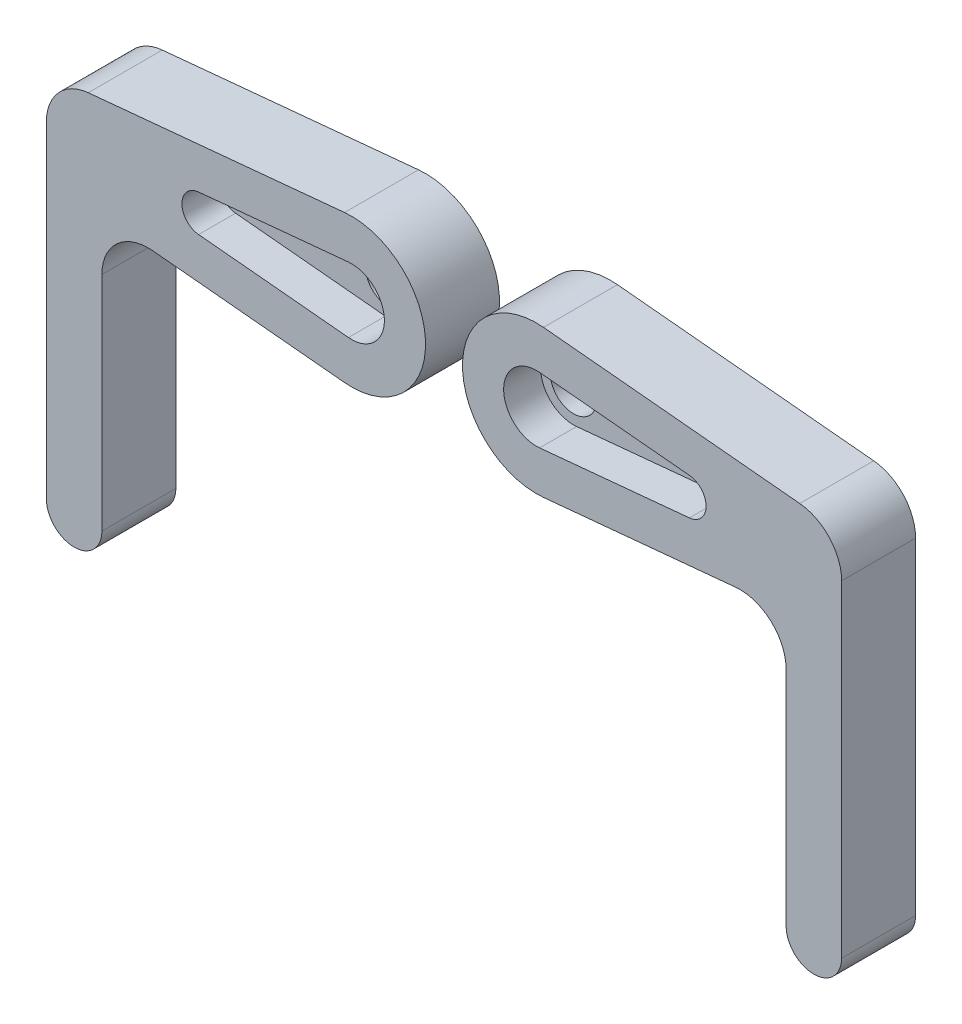
ISO-10303-21;
HEADER;
FILE_DESCRIPTION(('STEP AP214'),'2;1');
FILE_NAME('part.step','',(''),(''),'','','');
FILE_SCHEMA(('AUTOMOTIVE_DESIGN { 1 0 10303 214 1 1 1 1 }'));
ENDSEC;
DATA;
#1=APPLICATION_CONTEXT('core data for automotive mechanical design processes');
#2=APPLICATION_PROTOCOL_DEFINITION('international standard','automotive_design',2000,#1);
#3=PRODUCT_CONTEXT('',#1,'mechanical');
#4=PRODUCT('Part','Part','',(#3));
#5=PRODUCT_RELATED_PRODUCT_CATEGORY('part','',(#4));
#6=PRODUCT_DEFINITION_FORMATION('','',#4);
#7=PRODUCT_DEFINITION_CONTEXT('part definition',#1,'design');
#8=PRODUCT_DEFINITION('design','',#6,#7);
#9=PRODUCT_DEFINITION_SHAPE('','',#8);
#10=(LENGTH_UNIT() NAMED_UNIT(*) SI_UNIT(.MILLI.,.METRE.));
#11=(NAMED_UNIT(*) PLANE_ANGLE_UNIT() SI_UNIT($,.RADIAN.));
#12=(NAMED_UNIT(*) SI_UNIT($,.STERADIAN.) SOLID_ANGLE_UNIT());
#13=UNCERTAINTY_MEASURE_WITH_UNIT(LENGTH_MEASURE(1.E-05),#10,'distance_accuracy_value','');
#14=(GEOMETRIC_REPRESENTATION_CONTEXT(3) GLOBAL_UNCERTAINTY_ASSIGNED_CONTEXT((#13)) GLOBAL_UNIT_ASSIGNED_CONTEXT((#10,
#11,#12)) REPRESENTATION_CONTEXT('',''));
#15=CARTESIAN_POINT('',(0.,0.,0.));
#16=DIRECTION('',(0.,0.,1.));
#17=DIRECTION('',(1.,0.,0.));
#18=AXIS2_PLACEMENT_3D('',#15,#16,#17);
#19=CARTESIAN_POINT('',(-20.,0.,4.));
#20=DIRECTION('',(0.,0.,-1.));
#21=DIRECTION('',(1.,0.,0.));
#22=AXIS2_PLACEMENT_3D('',#19,#20,#21);
#23=PLANE('',#22);
#24=DIRECTION('',(0.,1.,0.));
#25=VECTOR('',#24,1.);
#26=CARTESIAN_POINT('',(-53.,-35.,4.));
#27=LINE('',#26,#25);
#28=CARTESIAN_POINT('',(-53.,-35.,4.));
#29=VERTEX_POINT('',#28);
#30=CARTESIAN_POINT('',(-53.,0.347129141817851,4.));
#31=VERTEX_POINT('',#30);
#32=EDGE_CURVE('E164',#29,#31,#27,.T.);
#33=ORIENTED_EDGE('',*,*,#32,.F.);
#34=CARTESIAN_POINT('',(-50.,-35.,4.));
#35=DIRECTION('',(0.,0.,-1.));
#36=DIRECTION('',(1.,0.,0.));
#37=AXIS2_PLACEMENT_3D('',#34,#35,#36);
#38=CIRCLE('',#37,3.);
#39=CARTESIAN_POINT('',(-47.,-35.,4.));
#40=VERTEX_POINT('',#39);
#41=EDGE_CURVE('E233',#40,#29,#38,.T.);
#42=ORIENTED_EDGE('',*,*,#41,.F.);
#43=DIRECTION('',(0.,-1.,0.));
#44=VECTOR('',#43,1.);
#45=CARTESIAN_POINT('',(-47.,-5.46498002915011,4.));
#46=LINE('',#45,#44);
#47=CARTESIAN_POINT('',(-47.,-10.9637513906896,4.));
#48=VERTEX_POINT('',#47);
#49=EDGE_CURVE('E231',#48,#40,#46,.T.);
#50=ORIENTED_EDGE('',*,*,#49,.F.);
#51=CARTESIAN_POINT('',(-42.,-10.9637513906896,4.));
#52=DIRECTION('',(0.,0.,1.));
#53=DIRECTION('',(1.,0.,0.));
#54=AXIS2_PLACEMENT_3D('',#51,#52,#53);
#55=CIRCLE('',#54,5.);
#56=CARTESIAN_POINT('',(-41.525993883792,-5.98627028054987,4.));
#57=VERTEX_POINT('',#56);
#58=EDGE_CURVE('E12',#57,#48,#55,.T.);
#59=ORIENTED_EDGE('',*,*,#58,.F.);
#60=DIRECTION('',(-0.995496222027938,0.0948012232415903,0.));
#61=VECTOR('',#60,1.);
#62=CARTESIAN_POINT('',(-20.7584097859327,-7.96396977622351,4.));
#63=LINE('',#62,#61);
#64=CARTESIAN_POINT('',(-20.7584097859327,-7.96396977622351,4.));
#65=VERTEX_POINT('',#64);
#66=EDGE_CURVE('E185',#65,#57,#63,.T.);
#67=ORIENTED_EDGE('',*,*,#66,.F.);
#68=CARTESIAN_POINT('',(-20.,0.,4.));
#69=DIRECTION('',(0.,0.,-1.));
#70=DIRECTION('',(1.,0.,0.));
#71=AXIS2_PLACEMENT_3D('',#68,#69,#70);
#72=CIRCLE('',#71,8.);
#73=CARTESIAN_POINT('',(-20.7584097859327,7.96396977622351,4.));
#74=VERTEX_POINT('',#73);
#75=EDGE_CURVE('E228',#74,#65,#72,.T.);
#76=ORIENTED_EDGE('',*,*,#75,.F.);
#77=DIRECTION('',(0.995496222027938,0.0948012232415902,0.));
#78=VECTOR('',#77,1.);
#79=CARTESIAN_POINT('',(-20.7584097859327,7.96396977622351,4.));
#80=LINE('',#79,#78);
#81=CARTESIAN_POINT('',(-48.4740061162079,5.32461025195755,4.));
#82=VERTEX_POINT('',#81);
#83=EDGE_CURVE('E157',#82,#74,#80,.T.);
#84=ORIENTED_EDGE('',*,*,#83,.F.);
#85=CARTESIAN_POINT('',(-48.,0.347129141817853,4.));
#86=DIRECTION('',(0.,0.,1.));
#87=DIRECTION('',(1.,0.,0.));
#88=AXIS2_PLACEMENT_3D('',#85,#86,#87);
#89=CIRCLE('',#88,5.);
#90=EDGE_CURVE('E176',#31,#82,#89,.F.);
#91=ORIENTED_EDGE('',*,*,#90,.F.);
#92=EDGE_LOOP('',(#33,#42,#50,#59,#67,#76,#84,#91));
#93=FACE_BOUND('',#92,.T.);
#94=CARTESIAN_POINT('',(-20.,0.,4.));
#95=DIRECTION('',(0.,0.,-1.));
#96=DIRECTION('',(-1.,0.,0.));
#97=AXIS2_PLACEMENT_3D('',#94,#95,#96);
#98=CIRCLE('',#97,3.55);
#99=CARTESIAN_POINT('',(-20.3365443425076,3.53401158819918,4.));
#100=VERTEX_POINT('',#99);
#101=CARTESIAN_POINT('',(-20.3365443425076,-3.53401158819918,4.));
#102=VERTEX_POINT('',#101);
#103=EDGE_CURVE('E197',#100,#102,#98,.T.);
#104=ORIENTED_EDGE('',*,*,#103,.T.);
#105=DIRECTION('',(-0.995496222027938,0.0948012232415903,0.));
#106=VECTOR('',#105,1.);
#107=CARTESIAN_POINT('',(-36.5396024464832,-1.99099244405587,4.));
#108=LINE('',#107,#106);
#109=CARTESIAN_POINT('',(-36.5396024464832,-1.99099244405587,4.));
#110=VERTEX_POINT('',#109);
#111=EDGE_CURVE('E200',#102,#110,#108,.T.);
#112=ORIENTED_EDGE('',*,*,#111,.T.);
#113=CARTESIAN_POINT('',(-36.35,0.,4.));
#114=DIRECTION('',(0.,0.,-1.));
#115=DIRECTION('',(-1.,0.,0.));
#116=AXIS2_PLACEMENT_3D('',#113,#114,#115);
#117=CIRCLE('',#116,2.);
#118=CARTESIAN_POINT('',(-36.5396024464832,1.99099244405587,4.));
#119=VERTEX_POINT('',#118);
#120=EDGE_CURVE('E204',#110,#119,#117,.T.);
#121=ORIENTED_EDGE('',*,*,#120,.T.);
#122=DIRECTION('',(0.995496222027938,0.0948012232415904,0.));
#123=VECTOR('',#122,1.);
#124=CARTESIAN_POINT('',(-20.3365443425076,3.53401158819918,4.));
#125=LINE('',#124,#123);
#126=EDGE_CURVE('E207',#119,#100,#125,.T.);
#127=ORIENTED_EDGE('',*,*,#126,.T.);
#128=EDGE_LOOP('',(#104,#112,#121,#127));
#129=FACE_BOUND('',#128,.T.);
#130=ADVANCED_FACE('F43',(#93,#129),#23,.F.);
#131=CARTESIAN_POINT('',(-20.,0.,4.));
#132=DIRECTION('',(0.,0.,-1.));
#133=DIRECTION('',(1.,0.,0.));
#134=AXIS2_PLACEMENT_3D('',#131,#132,#133);
#135=CYLINDRICAL_SURFACE('',#134,8.);
#136=DIRECTION('',(0.,0.,-1.));
#137=VECTOR('',#136,1.);
#138=CARTESIAN_POINT('',(-20.7584097859327,7.96396977622351,4.));
#139=LINE('',#138,#137);
#140=CARTESIAN_POINT('',(-20.7584097859327,7.96396977622351,-4.));
#141=VERTEX_POINT('',#140);
#142=EDGE_CURVE('E150',#74,#141,#139,.T.);
#143=ORIENTED_EDGE('',*,*,#142,.F.);
#144=ORIENTED_EDGE('',*,*,#75,.T.);
#145=DIRECTION('',(0.,0.,-1.));
#146=VECTOR('',#145,1.);
#147=CARTESIAN_POINT('',(-20.7584097859327,-7.96396977622351,4.));
#148=LINE('',#147,#146);
#149=CARTESIAN_POINT('',(-20.7584097859327,-7.9639697762235,-4.));
#150=VERTEX_POINT('',#149);
#151=EDGE_CURVE('E152',#65,#150,#148,.T.);
#152=ORIENTED_EDGE('',*,*,#151,.T.);
#153=CARTESIAN_POINT('',(-20.,0.,-4.));
#154=DIRECTION('',(0.,0.,1.));
#155=DIRECTION('',(1.,0.,0.));
#156=AXIS2_PLACEMENT_3D('',#153,#154,#155);
#157=CIRCLE('',#156,8.);
#158=EDGE_CURVE('E138',#150,#141,#157,.T.);
#159=ORIENTED_EDGE('',*,*,#158,.T.);
#160=EDGE_LOOP('',(#143,#144,#152,#159));
#161=FACE_BOUND('',#160,.T.);
#162=ADVANCED_FACE('F148',(#161),#135,.T.);
#163=CARTESIAN_POINT('',(-20.7584097859327,-7.96396977622351,4.));
#164=DIRECTION('',(0.0948012232415903,0.995496222027938,0.));
#165=DIRECTION('',(0.995496222027938,-0.0948012232415903,0.));
#166=AXIS2_PLACEMENT_3D('',#163,#164,#165);
#167=PLANE('',#166);
#168=DIRECTION('',(0.995496222027938,-0.0948012232415902,0.));
#169=VECTOR('',#168,1.);
#170=CARTESIAN_POINT('',(-20.7584097859327,-7.9639697762235,-4.));
#171=LINE('',#170,#169);
#172=CARTESIAN_POINT('',(-41.525993883792,-5.98627028054987,-4.));
#173=VERTEX_POINT('',#172);
#174=EDGE_CURVE('E183',#173,#150,#171,.T.);
#175=ORIENTED_EDGE('',*,*,#174,.T.);
#176=ORIENTED_EDGE('',*,*,#151,.F.);
#177=ORIENTED_EDGE('',*,*,#66,.T.);
#178=DIRECTION('',(0.,0.,-1.));
#179=VECTOR('',#178,1.);
#180=CARTESIAN_POINT('',(-41.525993883792,-5.98627028054987,4.));
#181=LINE('',#180,#179);
#182=EDGE_CURVE('E64',#173,#57,#181,.F.);
#183=ORIENTED_EDGE('',*,*,#182,.F.);
#184=EDGE_LOOP('',(#175,#176,#177,#183));
#185=FACE_BOUND('',#184,.T.);
#186=ADVANCED_FACE('F182',(#185),#167,.F.);
#187=CARTESIAN_POINT('',(-47.,-5.46498002915011,4.));
#188=DIRECTION('',(-1.,0.,0.));
#189=DIRECTION('',(0.,0.,-1.));
#190=AXIS2_PLACEMENT_3D('',#187,#188,#189);
#191=PLANE('',#190);
#192=ORIENTED_EDGE('',*,*,#49,.T.);
#193=DIRECTION('',(0.,0.,-1.));
#194=VECTOR('',#193,1.);
#195=CARTESIAN_POINT('',(-47.,-35.,4.));
#196=LINE('',#195,#194);
#197=CARTESIAN_POINT('',(-47.,-35.,-4.));
#198=VERTEX_POINT('',#197);
#199=EDGE_CURVE('E162',#40,#198,#196,.T.);
#200=ORIENTED_EDGE('',*,*,#199,.T.);
#201=DIRECTION('',(0.,1.,0.));
#202=VECTOR('',#201,1.);
#203=CARTESIAN_POINT('',(-47.,-5.46498002915011,-4.));
#204=LINE('',#203,#202);
#205=CARTESIAN_POINT('',(-47.,-10.9637513906896,-4.));
#206=VERTEX_POINT('',#205);
#207=EDGE_CURVE('E188',#198,#206,#204,.T.);
#208=ORIENTED_EDGE('',*,*,#207,.T.);
#209=DIRECTION('',(0.,0.,-1.));
#210=VECTOR('',#209,1.);
#211=CARTESIAN_POINT('',(-47.,-10.9637513906896,-4.));
#212=LINE('',#211,#210);
#213=EDGE_CURVE('E58',#48,#206,#212,.T.);
#214=ORIENTED_EDGE('',*,*,#213,.F.);
#215=EDGE_LOOP('',(#192,#200,#208,#214));
#216=FACE_BOUND('',#215,.T.);
#217=ADVANCED_FACE('F273',(#216),#191,.F.);
#218=CARTESIAN_POINT('',(-50.,-35.,4.));
#219=DIRECTION('',(0.,0.,-1.));
#220=DIRECTION('',(1.,0.,0.));
#221=AXIS2_PLACEMENT_3D('',#218,#219,#220);
#222=CYLINDRICAL_SURFACE('',#221,3.);
#223=ORIENTED_EDGE('',*,*,#199,.F.);
#224=ORIENTED_EDGE('',*,*,#41,.T.);
#225=DIRECTION('',(0.,0.,-1.));
#226=VECTOR('',#225,1.);
#227=CARTESIAN_POINT('',(-53.,-35.,4.));
#228=LINE('',#227,#226);
#229=CARTESIAN_POINT('',(-53.,-35.,-4.));
#230=VERTEX_POINT('',#229);
#231=EDGE_CURVE('E159',#29,#230,#228,.T.);
#232=ORIENTED_EDGE('',*,*,#231,.T.);
#233=CARTESIAN_POINT('',(-50.,-35.,-4.));
#234=DIRECTION('',(0.,0.,1.));
#235=DIRECTION('',(-1.,0.,0.));
#236=AXIS2_PLACEMENT_3D('',#233,#234,#235);
#237=CIRCLE('',#236,3.);
#238=EDGE_CURVE('E193',#230,#198,#237,.T.);
#239=ORIENTED_EDGE('',*,*,#238,.T.);
#240=EDGE_LOOP('',(#223,#224,#232,#239));
#241=FACE_BOUND('',#240,.T.);
#242=ADVANCED_FACE('F270',(#241),#222,.T.);
#243=CARTESIAN_POINT('',(-53.,-35.,4.));
#244=DIRECTION('',(1.,0.,0.));
#245=DIRECTION('',(0.,0.,1.));
#246=AXIS2_PLACEMENT_3D('',#243,#244,#245);
#247=PLANE('',#246);
#248=DIRECTION('',(0.,-1.,0.));
#249=VECTOR('',#248,1.);
#250=CARTESIAN_POINT('',(-53.,4.8935993178393,-4.));
#251=LINE('',#250,#249);
#252=CARTESIAN_POINT('',(-53.,0.347129141817853,-4.));
#253=VERTEX_POINT('',#252);
#254=EDGE_CURVE('E145',#253,#230,#251,.T.);
#255=ORIENTED_EDGE('',*,*,#254,.T.);
#256=ORIENTED_EDGE('',*,*,#231,.F.);
#257=ORIENTED_EDGE('',*,*,#32,.T.);
#258=DIRECTION('',(0.,0.,-1.));
#259=VECTOR('',#258,1.);
#260=CARTESIAN_POINT('',(-53.,0.347129141817851,4.));
#261=LINE('',#260,#259);
#262=EDGE_CURVE('E174',#253,#31,#261,.F.);
#263=ORIENTED_EDGE('',*,*,#262,.F.);
#264=EDGE_LOOP('',(#255,#256,#257,#263));
#265=FACE_BOUND('',#264,.T.);
#266=ADVANCED_FACE('F239',(#265),#247,.F.);
#267=CARTESIAN_POINT('',(-20.7584097859327,7.96396977622351,4.));
#268=DIRECTION('',(0.0948012232415903,-0.995496222027938,0.));
#269=DIRECTION('',(-0.995496222027938,-0.0948012232415903,0.));
#270=AXIS2_PLACEMENT_3D('',#267,#268,#269);
#271=PLANE('',#270);
#272=ORIENTED_EDGE('',*,*,#83,.T.);
#273=ORIENTED_EDGE('',*,*,#142,.T.);
#274=DIRECTION('',(-0.995496222027938,-0.0948012232415902,0.));
#275=VECTOR('',#274,1.);
#276=CARTESIAN_POINT('',(-20.7584097859327,7.96396977622351,-4.));
#277=LINE('',#276,#275);
#278=CARTESIAN_POINT('',(-48.4740061162079,5.32461025195755,-4.));
#279=VERTEX_POINT('',#278);
#280=EDGE_CURVE('E133',#141,#279,#277,.T.);
#281=ORIENTED_EDGE('',*,*,#280,.T.);
#282=DIRECTION('',(0.,0.,-1.));
#283=VECTOR('',#282,1.);
#284=CARTESIAN_POINT('',(-48.474006116208,5.32461025195755,4.));
#285=LINE('',#284,#283);
#286=EDGE_CURVE('E171',#82,#279,#285,.T.);
#287=ORIENTED_EDGE('',*,*,#286,.F.);
#288=EDGE_LOOP('',(#272,#273,#281,#287));
#289=FACE_BOUND('',#288,.T.);
#290=ADVANCED_FACE('F155',(#289),#271,.F.);
#291=CARTESIAN_POINT('',(-20.,0.,4.));
#292=DIRECTION('',(0.,0.,-1.));
#293=DIRECTION('',(1.,0.,0.));
#294=AXIS2_PLACEMENT_3D('',#291,#292,#293);
#295=CYLINDRICAL_SURFACE('',#294,3.55);
#296=CARTESIAN_POINT('',(-20.,0.,0.));
#297=DIRECTION('',(0.,0.,-1.));
#298=DIRECTION('',(-1.,0.,0.));
#299=AXIS2_PLACEMENT_3D('',#296,#297,#298);
#300=CIRCLE('',#299,3.55);
#301=CARTESIAN_POINT('',(-20.3365443425076,3.53401158819918,0.));
#302=VERTEX_POINT('',#301);
#303=CARTESIAN_POINT('',(-20.3365443425076,-3.53401158819918,0.));
#304=VERTEX_POINT('',#303);
#305=EDGE_CURVE('E187',#302,#304,#300,.T.);
#306=ORIENTED_EDGE('',*,*,#305,.T.);
#307=DIRECTION('',(0.,0.,-1.));
#308=VECTOR('',#307,1.);
#309=CARTESIAN_POINT('',(-20.3365443425076,-3.53401158819918,4.));
#310=LINE('',#309,#308);
#311=EDGE_CURVE('E225',#102,#304,#310,.T.);
#312=ORIENTED_EDGE('',*,*,#311,.F.);
#313=ORIENTED_EDGE('',*,*,#103,.F.);
#314=DIRECTION('',(0.,0.,-1.));
#315=VECTOR('',#314,1.);
#316=CARTESIAN_POINT('',(-20.3365443425076,3.53401158819918,4.));
#317=LINE('',#316,#315);
#318=EDGE_CURVE('E209',#100,#302,#317,.T.);
#319=ORIENTED_EDGE('',*,*,#318,.T.);
#320=EDGE_LOOP('',(#306,#312,#313,#319));
#321=FACE_BOUND('',#320,.T.);
#322=ADVANCED_FACE('F264',(#321),#295,.F.);
#323=CARTESIAN_POINT('',(-36.5396024464832,-1.99099244405587,4.));
#324=DIRECTION('',(0.0948012232415903,0.995496222027938,0.));
#325=DIRECTION('',(0.995496222027938,-0.0948012232415903,0.));
#326=AXIS2_PLACEMENT_3D('',#323,#324,#325);
#327=PLANE('',#326);
#328=DIRECTION('',(-0.995496222027938,0.0948012232415903,0.));
#329=VECTOR('',#328,1.);
#330=CARTESIAN_POINT('',(-36.5396024464832,-1.99099244405587,0.));
#331=LINE('',#330,#329);
#332=CARTESIAN_POINT('',(-36.5396024464832,-1.99099244405587,0.));
#333=VERTEX_POINT('',#332);
#334=EDGE_CURVE('E191',#304,#333,#331,.T.);
#335=ORIENTED_EDGE('',*,*,#334,.T.);
#336=DIRECTION('',(0.,0.,-1.));
#337=VECTOR('',#336,1.);
#338=CARTESIAN_POINT('',(-36.5396024464832,-1.99099244405587,4.));
#339=LINE('',#338,#337);
#340=EDGE_CURVE('E222',#110,#333,#339,.T.);
#341=ORIENTED_EDGE('',*,*,#340,.F.);
#342=ORIENTED_EDGE('',*,*,#111,.F.);
#343=ORIENTED_EDGE('',*,*,#311,.T.);
#344=EDGE_LOOP('',(#335,#341,#342,#343));
#345=FACE_BOUND('',#344,.T.);
#346=ADVANCED_FACE('F304',(#345),#327,.T.);
#347=CARTESIAN_POINT('',(-36.35,0.,4.));
#348=DIRECTION('',(0.,0.,-1.));
#349=DIRECTION('',(1.,0.,0.));
#350=AXIS2_PLACEMENT_3D('',#347,#348,#349);
#351=CYLINDRICAL_SURFACE('',#350,2.);
#352=CARTESIAN_POINT('',(-36.35,0.,0.));
#353=DIRECTION('',(0.,0.,-1.));
#354=DIRECTION('',(-1.,0.,0.));
#355=AXIS2_PLACEMENT_3D('',#352,#353,#354);
#356=CIRCLE('',#355,2.);
#357=CARTESIAN_POINT('',(-36.5396024464832,1.99099244405587,0.));
#358=VERTEX_POINT('',#357);
#359=EDGE_CURVE('E213',#333,#358,#356,.T.);
#360=ORIENTED_EDGE('',*,*,#359,.T.);
#361=DIRECTION('',(0.,0.,-1.));
#362=VECTOR('',#361,1.);
#363=CARTESIAN_POINT('',(-36.5396024464832,1.99099244405587,4.));
#364=LINE('',#363,#362);
#365=EDGE_CURVE('E219',#119,#358,#364,.T.);
#366=ORIENTED_EDGE('',*,*,#365,.F.);
#367=ORIENTED_EDGE('',*,*,#120,.F.);
#368=ORIENTED_EDGE('',*,*,#340,.T.);
#369=EDGE_LOOP('',(#360,#366,#367,#368));
#370=FACE_BOUND('',#369,.T.);
#371=ADVANCED_FACE('F311',(#370),#351,.F.);
#372=CARTESIAN_POINT('',(-20.3365443425076,3.53401158819918,4.));
#373=DIRECTION('',(0.0948012232415904,-0.995496222027938,0.));
#374=DIRECTION('',(-0.995496222027938,-0.0948012232415904,0.));
#375=AXIS2_PLACEMENT_3D('',#372,#373,#374);
#376=PLANE('',#375);
#377=DIRECTION('',(0.995496222027938,0.0948012232415904,0.));
#378=VECTOR('',#377,1.);
#379=CARTESIAN_POINT('',(-20.3365443425076,3.53401158819918,0.));
#380=LINE('',#379,#378);
#381=EDGE_CURVE('E201',#358,#302,#380,.T.);
#382=ORIENTED_EDGE('',*,*,#381,.T.);
#383=ORIENTED_EDGE('',*,*,#318,.F.);
#384=ORIENTED_EDGE('',*,*,#126,.F.);
#385=ORIENTED_EDGE('',*,*,#365,.T.);
#386=EDGE_LOOP('',(#382,#383,#384,#385));
#387=FACE_BOUND('',#386,.T.);
#388=ADVANCED_FACE('F318',(#387),#376,.T.);
#389=CARTESIAN_POINT('',(-20.,0.,-4.));
#390=DIRECTION('',(0.,0.,-1.));
#391=DIRECTION('',(1.,0.,0.));
#392=AXIS2_PLACEMENT_3D('',#389,#390,#391);
#393=PLANE('',#392);
#394=ORIENTED_EDGE('',*,*,#280,.F.);
#395=ORIENTED_EDGE('',*,*,#158,.F.);
#396=ORIENTED_EDGE('',*,*,#174,.F.);
#397=CARTESIAN_POINT('',(-42.,-10.9637513906896,-4.));
#398=DIRECTION('',(0.,0.,1.));
#399=DIRECTION('',(1.,0.,0.));
#400=AXIS2_PLACEMENT_3D('',#397,#398,#399);
#401=CIRCLE('',#400,5.);
#402=EDGE_CURVE('E51',#206,#173,#401,.F.);
#403=ORIENTED_EDGE('',*,*,#402,.F.);
#404=ORIENTED_EDGE('',*,*,#207,.F.);
#405=ORIENTED_EDGE('',*,*,#238,.F.);
#406=ORIENTED_EDGE('',*,*,#254,.F.);
#407=CARTESIAN_POINT('',(-48.,0.347129141817853,-4.));
#408=DIRECTION('',(0.,0.,1.));
#409=DIRECTION('',(1.,0.,0.));
#410=AXIS2_PLACEMENT_3D('',#407,#408,#409);
#411=CIRCLE('',#410,5.);
#412=EDGE_CURVE('E141',#279,#253,#411,.T.);
#413=ORIENTED_EDGE('',*,*,#412,.F.);
#414=EDGE_LOOP('',(#394,#395,#396,#403,#404,#405,#406,#413));
#415=FACE_BOUND('',#414,.T.);
#416=CARTESIAN_POINT('',(-20.,0.,-4.));
#417=DIRECTION('',(0.,0.,1.));
#418=DIRECTION('',(1.,0.,0.));
#419=AXIS2_PLACEMENT_3D('',#416,#417,#418);
#420=CIRCLE('',#419,2.5);
#421=CARTESIAN_POINT('',(-17.5,0.,-4.));
#422=VERTEX_POINT('',#421);
#423=EDGE_CURVE('E153',#422,#422,#420,.T.);
#424=ORIENTED_EDGE('',*,*,#423,.T.);
#425=EDGE_LOOP('',(#424));
#426=FACE_BOUND('',#425,.T.);
#427=ADVANCED_FACE('F135',(#415,#426),#393,.T.);
#428=CARTESIAN_POINT('',(-20.,0.,0.));
#429=DIRECTION('',(0.,0.,-1.));
#430=DIRECTION('',(1.,0.,0.));
#431=AXIS2_PLACEMENT_3D('',#428,#429,#430);
#432=PLANE('',#431);
#433=ORIENTED_EDGE('',*,*,#305,.F.);
#434=ORIENTED_EDGE('',*,*,#381,.F.);
#435=ORIENTED_EDGE('',*,*,#359,.F.);
#436=ORIENTED_EDGE('',*,*,#334,.F.);
#437=EDGE_LOOP('',(#433,#434,#435,#436));
#438=FACE_BOUND('',#437,.T.);
#439=CARTESIAN_POINT('',(-20.,0.,0.));
#440=DIRECTION('',(0.,0.,1.));
#441=DIRECTION('',(1.,0.,0.));
#442=AXIS2_PLACEMENT_3D('',#439,#440,#441);
#443=CIRCLE('',#442,2.5);
#444=CARTESIAN_POINT('',(-17.5,0.,0.));
#445=VERTEX_POINT('',#444);
#446=EDGE_CURVE('E413',#445,#445,#443,.T.);
#447=ORIENTED_EDGE('',*,*,#446,.F.);
#448=EDGE_LOOP('',(#447));
#449=FACE_BOUND('',#448,.T.);
#450=ADVANCED_FACE('F253',(#438,#449),#432,.F.);
#451=CARTESIAN_POINT('',(-20.,0.,-4.));
#452=DIRECTION('',(0.,0.,1.));
#453=DIRECTION('',(-1.,0.,0.));
#454=AXIS2_PLACEMENT_3D('',#451,#452,#453);
#455=CYLINDRICAL_SURFACE('',#454,2.5);
#456=ORIENTED_EDGE('',*,*,#423,.F.);
#457=EDGE_LOOP('',(#456));
#458=FACE_BOUND('',#457,.T.);
#459=ORIENTED_EDGE('',*,*,#446,.T.);
#460=EDGE_LOOP('',(#459));
#461=FACE_BOUND('',#460,.T.);
#462=ADVANCED_FACE('F248',(#458,#461),#455,.F.);
#463=CARTESIAN_POINT('',(-48.,0.347129141817853,4.));
#464=DIRECTION('',(0.,0.,-1.));
#465=DIRECTION('',(1.,0.,0.));
#466=AXIS2_PLACEMENT_3D('',#463,#464,#465);
#467=CYLINDRICAL_SURFACE('',#466,5.);
#468=ORIENTED_EDGE('',*,*,#90,.T.);
#469=ORIENTED_EDGE('',*,*,#286,.T.);
#470=ORIENTED_EDGE('',*,*,#412,.T.);
#471=ORIENTED_EDGE('',*,*,#262,.T.);
#472=EDGE_LOOP('',(#468,#469,#470,#471));
#473=FACE_BOUND('',#472,.T.);
#474=ADVANCED_FACE('F246',(#473),#467,.T.);
#475=CARTESIAN_POINT('',(-42.,-10.9637513906896,4.));
#476=DIRECTION('',(0.,0.,1.));
#477=DIRECTION('',(-1.,0.,0.));
#478=AXIS2_PLACEMENT_3D('',#475,#476,#477);
#479=CYLINDRICAL_SURFACE('',#478,5.);
#480=ORIENTED_EDGE('',*,*,#58,.T.);
#481=ORIENTED_EDGE('',*,*,#213,.T.);
#482=ORIENTED_EDGE('',*,*,#402,.T.);
#483=ORIENTED_EDGE('',*,*,#182,.T.);
#484=EDGE_LOOP('',(#480,#481,#482,#483));
#485=FACE_BOUND('',#484,.T.);
#486=ADVANCED_FACE('F45',(#485),#479,.F.);
#487=CLOSED_SHELL('',(#130,#162,#186,#217,#242,#266,#290,#322,#346,#371,#388,#427,#450,#462,
#474,#486));
#488=MANIFOLD_SOLID_BREP('B2',#487);
#489=CARTESIAN_POINT('',(0.,0.,4.));
#490=DIRECTION('',(0.,0.,-1.));
#491=DIRECTION('',(-1.,0.,0.));
#492=AXIS2_PLACEMENT_3D('',#489,#490,#491);
#493=PLANE('',#492);
#494=DIRECTION('',(0.,1.,0.));
#495=VECTOR('',#494,1.);
#496=CARTESIAN_POINT('',(33.,-35.,4.));
#497=LINE('',#496,#495);
#498=CARTESIAN_POINT('',(33.,-35.,4.));
#499=VERTEX_POINT('',#498);
#500=CARTESIAN_POINT('',(33.,0.347129141817851,4.));
#501=VERTEX_POINT('',#500);
#502=EDGE_CURVE('E595',#499,#501,#497,.T.);
#503=ORIENTED_EDGE('',*,*,#502,.T.);
#504=CARTESIAN_POINT('',(28.,0.347129141817853,4.));
#505=DIRECTION('',(0.,0.,-1.));
#506=DIRECTION('',(-1.,0.,0.));
#507=AXIS2_PLACEMENT_3D('',#504,#505,#506);
#508=CIRCLE('',#507,5.);
#509=CARTESIAN_POINT('',(28.4740061162079,5.32461025195755,4.));
#510=VERTEX_POINT('',#509);
#511=EDGE_CURVE('E610',#501,#510,#508,.F.);
#512=ORIENTED_EDGE('',*,*,#511,.T.);
#513=DIRECTION('',(-0.995496222027938,0.0948012232415902,0.));
#514=VECTOR('',#513,1.);
#515=CARTESIAN_POINT('',(0.758409785932722,7.96396977622351,4.));
#516=LINE('',#515,#514);
#517=CARTESIAN_POINT('',(0.758409785932722,7.96396977622351,4.));
#518=VERTEX_POINT('',#517);
#519=EDGE_CURVE('E528',#510,#518,#516,.T.);
#520=ORIENTED_EDGE('',*,*,#519,.T.);
#521=CARTESIAN_POINT('',(0.,0.,4.));
#522=DIRECTION('',(0.,0.,1.));
#523=DIRECTION('',(-1.,0.,0.));
#524=AXIS2_PLACEMENT_3D('',#521,#522,#523);
#525=CIRCLE('',#524,8.);
#526=CARTESIAN_POINT('',(0.758409785932724,-7.96396977622351,4.));
#527=VERTEX_POINT('',#526);
#528=EDGE_CURVE('E524',#518,#527,#525,.T.);
#529=ORIENTED_EDGE('',*,*,#528,.T.);
#530=DIRECTION('',(0.995496222027938,0.0948012232415903,0.));
#531=VECTOR('',#530,1.);
#532=CARTESIAN_POINT('',(0.758409785932724,-7.96396977622351,4.));
#533=LINE('',#532,#531);
#534=CARTESIAN_POINT('',(21.5259938837921,-5.98627028054987,4.));
#535=VERTEX_POINT('',#534);
#536=EDGE_CURVE('E589',#527,#535,#533,.T.);
#537=ORIENTED_EDGE('',*,*,#536,.T.);
#538=CARTESIAN_POINT('',(22.,-10.9637513906896,4.));
#539=DIRECTION('',(0.,0.,-1.));
#540=DIRECTION('',(-1.,0.,0.));
#541=AXIS2_PLACEMENT_3D('',#538,#539,#540);
#542=CIRCLE('',#541,5.);
#543=CARTESIAN_POINT('',(27.,-10.9637513906896,4.));
#544=VERTEX_POINT('',#543);
#545=EDGE_CURVE('E41',#535,#544,#542,.T.);
#546=ORIENTED_EDGE('',*,*,#545,.T.);
#547=DIRECTION('',(0.,-1.,0.));
#548=VECTOR('',#547,1.);
#549=CARTESIAN_POINT('',(27.,-5.46498002915011,4.));
#550=LINE('',#549,#548);
#551=CARTESIAN_POINT('',(27.,-35.,4.));
#552=VERTEX_POINT('',#551);
#553=EDGE_CURVE('E591',#544,#552,#550,.T.);
#554=ORIENTED_EDGE('',*,*,#553,.T.);
#555=CARTESIAN_POINT('',(30.,-35.,4.));
#556=DIRECTION('',(0.,0.,1.));
#557=DIRECTION('',(-1.,0.,0.));
#558=AXIS2_PLACEMENT_3D('',#555,#556,#557);
#559=CIRCLE('',#558,3.);
#560=EDGE_CURVE('E593',#552,#499,#559,.T.);
#561=ORIENTED_EDGE('',*,*,#560,.T.);
#562=EDGE_LOOP('',(#503,#512,#520,#529,#537,#546,#554,#561));
#563=FACE_BOUND('',#562,.T.);
#564=CARTESIAN_POINT('',(0.,0.,4.));
#565=DIRECTION('',(0.,0.,1.));
#566=DIRECTION('',(1.,0.,0.));
#567=AXIS2_PLACEMENT_3D('',#564,#565,#566);
#568=CIRCLE('',#567,3.55);
#569=CARTESIAN_POINT('',(0.336544342507645,3.53401158819918,4.));
#570=VERTEX_POINT('',#569);
#571=CARTESIAN_POINT('',(0.336544342507645,-3.53401158819918,4.));
#572=VERTEX_POINT('',#571);
#573=EDGE_CURVE('E559',#570,#572,#568,.T.);
#574=ORIENTED_EDGE('',*,*,#573,.F.);
#575=DIRECTION('',(-0.995496222027938,0.0948012232415904,0.));
#576=VECTOR('',#575,1.);
#577=CARTESIAN_POINT('',(0.336544342507645,3.53401158819918,4.));
#578=LINE('',#577,#576);
#579=CARTESIAN_POINT('',(16.5396024464832,1.99099244405587,4.));
#580=VERTEX_POINT('',#579);
#581=EDGE_CURVE('E567',#580,#570,#578,.T.);
#582=ORIENTED_EDGE('',*,*,#581,.F.);
#583=CARTESIAN_POINT('',(16.35,0.,4.));
#584=DIRECTION('',(0.,0.,1.));
#585=DIRECTION('',(1.,0.,0.));
#586=AXIS2_PLACEMENT_3D('',#583,#584,#585);
#587=CIRCLE('',#586,2.);
#588=CARTESIAN_POINT('',(16.5396024464832,-1.99099244405587,4.));
#589=VERTEX_POINT('',#588);
#590=EDGE_CURVE('E564',#589,#580,#587,.T.);
#591=ORIENTED_EDGE('',*,*,#590,.F.);
#592=DIRECTION('',(0.995496222027938,0.0948012232415903,0.));
#593=VECTOR('',#592,1.);
#594=CARTESIAN_POINT('',(16.5396024464832,-1.99099244405587,4.));
#595=LINE('',#594,#593);
#596=EDGE_CURVE('E561',#572,#589,#595,.T.);
#597=ORIENTED_EDGE('',*,*,#596,.F.);
#598=EDGE_LOOP('',(#574,#582,#591,#597));
#599=FACE_BOUND('',#598,.T.);
#600=ADVANCED_FACE('F428',(#563,#599),#493,.F.);
#601=CARTESIAN_POINT('',(0.,0.,4.));
#602=DIRECTION('',(0.,0.,-1.));
#603=DIRECTION('',(-1.,0.,0.));
#604=AXIS2_PLACEMENT_3D('',#601,#602,#603);
#605=CYLINDRICAL_SURFACE('',#604,8.);
#606=DIRECTION('',(0.,0.,-1.));
#607=VECTOR('',#606,1.);
#608=CARTESIAN_POINT('',(0.758409785932722,7.96396977622351,4.));
#609=LINE('',#608,#607);
#610=CARTESIAN_POINT('',(0.758409785932722,7.96396977622351,-4.));
#611=VERTEX_POINT('',#610);
#612=EDGE_CURVE('E517',#518,#611,#609,.T.);
#613=ORIENTED_EDGE('',*,*,#612,.T.);
#614=CARTESIAN_POINT('',(0.,0.,-4.));
#615=DIRECTION('',(0.,0.,-1.));
#616=DIRECTION('',(-1.,0.,0.));
#617=AXIS2_PLACEMENT_3D('',#614,#615,#616);
#618=CIRCLE('',#617,8.);
#619=CARTESIAN_POINT('',(0.758409785932721,-7.9639697762235,-4.));
#620=VERTEX_POINT('',#619);
#621=EDGE_CURVE('E522',#620,#611,#618,.T.);
#622=ORIENTED_EDGE('',*,*,#621,.F.);
#623=DIRECTION('',(0.,0.,-1.));
#624=VECTOR('',#623,1.);
#625=CARTESIAN_POINT('',(0.758409785932724,-7.96396977622351,4.));
#626=LINE('',#625,#624);
#627=EDGE_CURVE('E603',#527,#620,#626,.T.);
#628=ORIENTED_EDGE('',*,*,#627,.F.);
#629=ORIENTED_EDGE('',*,*,#528,.F.);
#630=EDGE_LOOP('',(#613,#622,#628,#629));
#631=FACE_BOUND('',#630,.T.);
#632=ADVANCED_FACE('F519',(#631),#605,.T.);
#633=CARTESIAN_POINT('',(0.758409785932724,-7.96396977622351,4.));
#634=DIRECTION('',(-0.0948012232415903,0.995496222027938,0.));
#635=DIRECTION('',(-0.995496222027938,-0.0948012232415903,0.));
#636=AXIS2_PLACEMENT_3D('',#633,#634,#635);
#637=PLANE('',#636);
#638=DIRECTION('',(-0.995496222027938,-0.0948012232415902,0.));
#639=VECTOR('',#638,1.);
#640=CARTESIAN_POINT('',(0.758409785932721,-7.9639697762235,-4.));
#641=LINE('',#640,#639);
#642=CARTESIAN_POINT('',(21.525993883792,-5.98627028054987,-4.));
#643=VERTEX_POINT('',#642);
#644=EDGE_CURVE('E541',#643,#620,#641,.T.);
#645=ORIENTED_EDGE('',*,*,#644,.F.);
#646=DIRECTION('',(0.,0.,-1.));
#647=VECTOR('',#646,1.);
#648=CARTESIAN_POINT('',(21.525993883792,-5.98627028054987,4.));
#649=LINE('',#648,#647);
#650=EDGE_CURVE('E449',#643,#535,#649,.F.);
#651=ORIENTED_EDGE('',*,*,#650,.T.);
#652=ORIENTED_EDGE('',*,*,#536,.F.);
#653=ORIENTED_EDGE('',*,*,#627,.T.);
#654=EDGE_LOOP('',(#645,#651,#652,#653));
#655=FACE_BOUND('',#654,.T.);
#656=ADVANCED_FACE('F618',(#655),#637,.F.);
#657=CARTESIAN_POINT('',(27.,-5.46498002915011,4.));
#658=DIRECTION('',(1.,0.,0.));
#659=DIRECTION('',(0.,0.,-1.));
#660=AXIS2_PLACEMENT_3D('',#657,#658,#659);
#661=PLANE('',#660);
#662=ORIENTED_EDGE('',*,*,#553,.F.);
#663=DIRECTION('',(0.,0.,-1.));
#664=VECTOR('',#663,1.);
#665=CARTESIAN_POINT('',(27.,-10.9637513906896,-4.));
#666=LINE('',#665,#664);
#667=CARTESIAN_POINT('',(27.,-10.9637513906896,-4.));
#668=VERTEX_POINT('',#667);
#669=EDGE_CURVE('E612',#544,#668,#666,.T.);
#670=ORIENTED_EDGE('',*,*,#669,.T.);
#671=DIRECTION('',(0.,1.,0.));
#672=VECTOR('',#671,1.);
#673=CARTESIAN_POINT('',(27.,-5.46498002915011,-4.));
#674=LINE('',#673,#672);
#675=CARTESIAN_POINT('',(27.,-35.,-4.));
#676=VERTEX_POINT('',#675);
#677=EDGE_CURVE('E554',#676,#668,#674,.T.);
#678=ORIENTED_EDGE('',*,*,#677,.F.);
#679=DIRECTION('',(0.,0.,-1.));
#680=VECTOR('',#679,1.);
#681=CARTESIAN_POINT('',(27.,-35.,4.));
#682=LINE('',#681,#680);
#683=EDGE_CURVE('E601',#552,#676,#682,.T.);
#684=ORIENTED_EDGE('',*,*,#683,.F.);
#685=EDGE_LOOP('',(#662,#670,#678,#684));
#686=FACE_BOUND('',#685,.T.);
#687=ADVANCED_FACE('F620',(#686),#661,.F.);
#688=CARTESIAN_POINT('',(30.,-35.,4.));
#689=DIRECTION('',(0.,0.,-1.));
#690=DIRECTION('',(-1.,0.,0.));
#691=AXIS2_PLACEMENT_3D('',#688,#689,#690);
#692=CYLINDRICAL_SURFACE('',#691,3.);
#693=ORIENTED_EDGE('',*,*,#683,.T.);
#694=CARTESIAN_POINT('',(30.,-35.,-4.));
#695=DIRECTION('',(0.,0.,-1.));
#696=DIRECTION('',(1.,0.,0.));
#697=AXIS2_PLACEMENT_3D('',#694,#695,#696);
#698=CIRCLE('',#697,3.);
#699=CARTESIAN_POINT('',(33.,-35.,-4.));
#700=VERTEX_POINT('',#699);
#701=EDGE_CURVE('E551',#700,#676,#698,.T.);
#702=ORIENTED_EDGE('',*,*,#701,.F.);
#703=DIRECTION('',(0.,0.,-1.));
#704=VECTOR('',#703,1.);
#705=CARTESIAN_POINT('',(33.,-35.,4.));
#706=LINE('',#705,#704);
#707=EDGE_CURVE('E527',#499,#700,#706,.T.);
#708=ORIENTED_EDGE('',*,*,#707,.F.);
#709=ORIENTED_EDGE('',*,*,#560,.F.);
#710=EDGE_LOOP('',(#693,#702,#708,#709));
#711=FACE_BOUND('',#710,.T.);
#712=ADVANCED_FACE('F629',(#711),#692,.T.);
#713=CARTESIAN_POINT('',(33.,-35.,4.));
#714=DIRECTION('',(-1.,0.,0.));
#715=DIRECTION('',(0.,0.,1.));
#716=AXIS2_PLACEMENT_3D('',#713,#714,#715);
#717=PLANE('',#716);
#718=DIRECTION('',(0.,-1.,0.));
#719=VECTOR('',#718,1.);
#720=CARTESIAN_POINT('',(33.,4.8935993178393,-4.));
#721=LINE('',#720,#719);
#722=CARTESIAN_POINT('',(33.,0.347129141817853,-4.));
#723=VERTEX_POINT('',#722);
#724=EDGE_CURVE('E537',#723,#700,#721,.T.);
#725=ORIENTED_EDGE('',*,*,#724,.F.);
#726=DIRECTION('',(0.,0.,-1.));
#727=VECTOR('',#726,1.);
#728=CARTESIAN_POINT('',(33.,0.347129141817851,4.));
#729=LINE('',#728,#727);
#730=EDGE_CURVE('E608',#723,#501,#729,.F.);
#731=ORIENTED_EDGE('',*,*,#730,.T.);
#732=ORIENTED_EDGE('',*,*,#502,.F.);
#733=ORIENTED_EDGE('',*,*,#707,.T.);
#734=EDGE_LOOP('',(#725,#731,#732,#733));
#735=FACE_BOUND('',#734,.T.);
#736=ADVANCED_FACE('F632',(#735),#717,.F.);
#737=CARTESIAN_POINT('',(0.758409785932722,7.96396977622351,4.));
#738=DIRECTION('',(-0.0948012232415903,-0.995496222027938,0.));
#739=DIRECTION('',(0.995496222027938,-0.0948012232415903,0.));
#740=AXIS2_PLACEMENT_3D('',#737,#738,#739);
#741=PLANE('',#740);
#742=ORIENTED_EDGE('',*,*,#519,.F.);
#743=DIRECTION('',(0.,0.,-1.));
#744=VECTOR('',#743,1.);
#745=CARTESIAN_POINT('',(28.474006116208,5.32461025195755,4.));
#746=LINE('',#745,#744);
#747=CARTESIAN_POINT('',(28.4740061162079,5.32461025195755,-4.));
#748=VERTEX_POINT('',#747);
#749=EDGE_CURVE('E535',#510,#748,#746,.T.);
#750=ORIENTED_EDGE('',*,*,#749,.T.);
#751=DIRECTION('',(0.995496222027938,-0.0948012232415902,0.));
#752=VECTOR('',#751,1.);
#753=CARTESIAN_POINT('',(0.758409785932722,7.96396977622351,-4.));
#754=LINE('',#753,#752);
#755=EDGE_CURVE('E532',#611,#748,#754,.T.);
#756=ORIENTED_EDGE('',*,*,#755,.F.);
#757=ORIENTED_EDGE('',*,*,#612,.F.);
#758=EDGE_LOOP('',(#742,#750,#756,#757));
#759=FACE_BOUND('',#758,.T.);
#760=ADVANCED_FACE('F533',(#759),#741,.F.);
#761=CARTESIAN_POINT('',(0.,0.,4.));
#762=DIRECTION('',(0.,0.,-1.));
#763=DIRECTION('',(-1.,0.,0.));
#764=AXIS2_PLACEMENT_3D('',#761,#762,#763);
#765=CYLINDRICAL_SURFACE('',#764,3.55);
#766=CARTESIAN_POINT('',(0.,0.,0.));
#767=DIRECTION('',(0.,0.,1.));
#768=DIRECTION('',(1.,0.,0.));
#769=AXIS2_PLACEMENT_3D('',#766,#767,#768);
#770=CIRCLE('',#769,3.55);
#771=CARTESIAN_POINT('',(0.336544342507645,3.53401158819918,0.));
#772=VERTEX_POINT('',#771);
#773=CARTESIAN_POINT('',(0.336544342507645,-3.53401158819918,0.));
#774=VERTEX_POINT('',#773);
#775=EDGE_CURVE('E558',#772,#774,#770,.T.);
#776=ORIENTED_EDGE('',*,*,#775,.F.);
#777=DIRECTION('',(0.,0.,-1.));
#778=VECTOR('',#777,1.);
#779=CARTESIAN_POINT('',(0.336544342507645,3.53401158819918,4.));
#780=LINE('',#779,#778);
#781=EDGE_CURVE('E569',#570,#772,#780,.T.);
#782=ORIENTED_EDGE('',*,*,#781,.F.);
#783=ORIENTED_EDGE('',*,*,#573,.T.);
#784=DIRECTION('',(0.,0.,-1.));
#785=VECTOR('',#784,1.);
#786=CARTESIAN_POINT('',(0.336544342507645,-3.53401158819918,4.));
#787=LINE('',#786,#785);
#788=EDGE_CURVE('E585',#572,#774,#787,.T.);
#789=ORIENTED_EDGE('',*,*,#788,.T.);
#790=EDGE_LOOP('',(#776,#782,#783,#789));
#791=FACE_BOUND('',#790,.T.);
#792=ADVANCED_FACE('F653',(#791),#765,.F.);
#793=CARTESIAN_POINT('',(16.5396024464832,-1.99099244405587,4.));
#794=DIRECTION('',(-0.0948012232415903,0.995496222027938,0.));
#795=DIRECTION('',(-0.995496222027938,-0.0948012232415903,0.));
#796=AXIS2_PLACEMENT_3D('',#793,#794,#795);
#797=PLANE('',#796);
#798=DIRECTION('',(0.995496222027938,0.0948012232415903,0.));
#799=VECTOR('',#798,1.);
#800=CARTESIAN_POINT('',(16.5396024464832,-1.99099244405587,0.));
#801=LINE('',#800,#799);
#802=CARTESIAN_POINT('',(16.5396024464832,-1.99099244405587,0.));
#803=VERTEX_POINT('',#802);
#804=EDGE_CURVE('E572',#774,#803,#801,.T.);
#805=ORIENTED_EDGE('',*,*,#804,.F.);
#806=ORIENTED_EDGE('',*,*,#788,.F.);
#807=ORIENTED_EDGE('',*,*,#596,.T.);
#808=DIRECTION('',(0.,0.,-1.));
#809=VECTOR('',#808,1.);
#810=CARTESIAN_POINT('',(16.5396024464832,-1.99099244405587,4.));
#811=LINE('',#810,#809);
#812=EDGE_CURVE('E583',#589,#803,#811,.T.);
#813=ORIENTED_EDGE('',*,*,#812,.T.);
#814=EDGE_LOOP('',(#805,#806,#807,#813));
#815=FACE_BOUND('',#814,.T.);
#816=ADVANCED_FACE('F691',(#815),#797,.T.);
#817=CARTESIAN_POINT('',(16.35,0.,4.));
#818=DIRECTION('',(0.,0.,-1.));
#819=DIRECTION('',(-1.,0.,0.));
#820=AXIS2_PLACEMENT_3D('',#817,#818,#819);
#821=CYLINDRICAL_SURFACE('',#820,2.);
#822=CARTESIAN_POINT('',(16.35,0.,0.));
#823=DIRECTION('',(0.,0.,1.));
#824=DIRECTION('',(1.,0.,0.));
#825=AXIS2_PLACEMENT_3D('',#822,#823,#824);
#826=CIRCLE('',#825,2.);
#827=CARTESIAN_POINT('',(16.5396024464832,1.99099244405587,0.));
#828=VERTEX_POINT('',#827);
#829=EDGE_CURVE('E575',#803,#828,#826,.T.);
#830=ORIENTED_EDGE('',*,*,#829,.F.);
#831=ORIENTED_EDGE('',*,*,#812,.F.);
#832=ORIENTED_EDGE('',*,*,#590,.T.);
#833=DIRECTION('',(0.,0.,-1.));
#834=VECTOR('',#833,1.);
#835=CARTESIAN_POINT('',(16.5396024464832,1.99099244405587,4.));
#836=LINE('',#835,#834);
#837=EDGE_CURVE('E581',#580,#828,#836,.T.);
#838=ORIENTED_EDGE('',*,*,#837,.T.);
#839=EDGE_LOOP('',(#830,#831,#832,#838));
#840=FACE_BOUND('',#839,.T.);
#841=ADVANCED_FACE('F698',(#840),#821,.F.);
#842=CARTESIAN_POINT('',(0.336544342507645,3.53401158819918,4.));
#843=DIRECTION('',(-0.0948012232415904,-0.995496222027938,0.));
#844=DIRECTION('',(0.995496222027938,-0.0948012232415904,0.));
#845=AXIS2_PLACEMENT_3D('',#842,#843,#844);
#846=PLANE('',#845);
#847=DIRECTION('',(-0.995496222027938,0.0948012232415904,0.));
#848=VECTOR('',#847,1.);
#849=CARTESIAN_POINT('',(0.336544342507645,3.53401158819918,0.));
#850=LINE('',#849,#848);
#851=EDGE_CURVE('E562',#828,#772,#850,.T.);
#852=ORIENTED_EDGE('',*,*,#851,.F.);
#853=ORIENTED_EDGE('',*,*,#837,.F.);
#854=ORIENTED_EDGE('',*,*,#581,.T.);
#855=ORIENTED_EDGE('',*,*,#781,.T.);
#856=EDGE_LOOP('',(#852,#853,#854,#855));
#857=FACE_BOUND('',#856,.T.);
#858=ADVANCED_FACE('F705',(#857),#846,.T.);
#859=CARTESIAN_POINT('',(0.,0.,-4.));
#860=DIRECTION('',(0.,0.,-1.));
#861=DIRECTION('',(-1.,0.,0.));
#862=AXIS2_PLACEMENT_3D('',#859,#860,#861);
#863=PLANE('',#862);
#864=ORIENTED_EDGE('',*,*,#755,.T.);
#865=CARTESIAN_POINT('',(28.,0.347129141817853,-4.));
#866=DIRECTION('',(0.,0.,-1.));
#867=DIRECTION('',(-1.,0.,0.));
#868=AXIS2_PLACEMENT_3D('',#865,#866,#867);
#869=CIRCLE('',#868,5.);
#870=EDGE_CURVE('E606',#748,#723,#869,.T.);
#871=ORIENTED_EDGE('',*,*,#870,.T.);
#872=ORIENTED_EDGE('',*,*,#724,.T.);
#873=ORIENTED_EDGE('',*,*,#701,.T.);
#874=ORIENTED_EDGE('',*,*,#677,.T.);
#875=CARTESIAN_POINT('',(22.,-10.9637513906896,-4.));
#876=DIRECTION('',(0.,0.,-1.));
#877=DIRECTION('',(-1.,0.,0.));
#878=AXIS2_PLACEMENT_3D('',#875,#876,#877);
#879=CIRCLE('',#878,5.);
#880=EDGE_CURVE('E436',#668,#643,#879,.F.);
#881=ORIENTED_EDGE('',*,*,#880,.T.);
#882=ORIENTED_EDGE('',*,*,#644,.T.);
#883=ORIENTED_EDGE('',*,*,#621,.T.);
#884=EDGE_LOOP('',(#864,#871,#872,#873,#874,#881,#882,#883));
#885=FACE_BOUND('',#884,.T.);
#886=CARTESIAN_POINT('',(0.,0.,-4.));
#887=DIRECTION('',(0.,0.,-1.));
#888=DIRECTION('',(-1.,0.,0.));
#889=AXIS2_PLACEMENT_3D('',#886,#887,#888);
#890=CIRCLE('',#889,2.5);
#891=CARTESIAN_POINT('',(-2.5,0.,-4.));
#892=VERTEX_POINT('',#891);
#893=EDGE_CURVE('E543',#892,#892,#890,.T.);
#894=ORIENTED_EDGE('',*,*,#893,.F.);
#895=EDGE_LOOP('',(#894));
#896=FACE_BOUND('',#895,.T.);
#897=ADVANCED_FACE('F539',(#885,#896),#863,.T.);
#898=CARTESIAN_POINT('',(0.,0.,0.));
#899=DIRECTION('',(0.,0.,-1.));
#900=DIRECTION('',(-1.,0.,0.));
#901=AXIS2_PLACEMENT_3D('',#898,#899,#900);
#902=PLANE('',#901);
#903=ORIENTED_EDGE('',*,*,#775,.T.);
#904=ORIENTED_EDGE('',*,*,#804,.T.);
#905=ORIENTED_EDGE('',*,*,#829,.T.);
#906=ORIENTED_EDGE('',*,*,#851,.T.);
#907=EDGE_LOOP('',(#903,#904,#905,#906));
#908=FACE_BOUND('',#907,.T.);
#909=CARTESIAN_POINT('',(0.,0.,0.));
#910=DIRECTION('',(0.,0.,-1.));
#911=DIRECTION('',(-1.,0.,0.));
#912=AXIS2_PLACEMENT_3D('',#909,#910,#911);
#913=CIRCLE('',#912,2.5);
#914=CARTESIAN_POINT('',(-2.5,0.,0.));
#915=VERTEX_POINT('',#914);
#916=EDGE_CURVE('E546',#915,#915,#913,.T.);
#917=ORIENTED_EDGE('',*,*,#916,.T.);
#918=EDGE_LOOP('',(#917));
#919=FACE_BOUND('',#918,.T.);
#920=ADVANCED_FACE('F642',(#908,#919),#902,.F.);
#921=CARTESIAN_POINT('',(0.,0.,-4.));
#922=DIRECTION('',(0.,0.,1.));
#923=DIRECTION('',(1.,0.,0.));
#924=AXIS2_PLACEMENT_3D('',#921,#922,#923);
#925=CYLINDRICAL_SURFACE('',#924,2.5);
#926=ORIENTED_EDGE('',*,*,#893,.T.);
#927=EDGE_LOOP('',(#926));
#928=FACE_BOUND('',#927,.T.);
#929=ORIENTED_EDGE('',*,*,#916,.F.);
#930=EDGE_LOOP('',(#929));
#931=FACE_BOUND('',#930,.T.);
#932=ADVANCED_FACE('F637',(#928,#931),#925,.F.);
#933=CARTESIAN_POINT('',(28.,0.347129141817853,4.));
#934=DIRECTION('',(0.,0.,-1.));
#935=DIRECTION('',(-1.,0.,0.));
#936=AXIS2_PLACEMENT_3D('',#933,#934,#935);
#937=CYLINDRICAL_SURFACE('',#936,5.);
#938=ORIENTED_EDGE('',*,*,#511,.F.);
#939=ORIENTED_EDGE('',*,*,#730,.F.);
#940=ORIENTED_EDGE('',*,*,#870,.F.);
#941=ORIENTED_EDGE('',*,*,#749,.F.);
#942=EDGE_LOOP('',(#938,#939,#940,#941));
#943=FACE_BOUND('',#942,.T.);
#944=ADVANCED_FACE('F635',(#943),#937,.T.);
#945=CARTESIAN_POINT('',(22.,-10.9637513906896,4.));
#946=DIRECTION('',(0.,0.,1.));
#947=DIRECTION('',(1.,0.,0.));
#948=AXIS2_PLACEMENT_3D('',#945,#946,#947);
#949=CYLINDRICAL_SURFACE('',#948,5.);
#950=ORIENTED_EDGE('',*,*,#545,.F.);
#951=ORIENTED_EDGE('',*,*,#650,.F.);
#952=ORIENTED_EDGE('',*,*,#880,.F.);
#953=ORIENTED_EDGE('',*,*,#669,.F.);
#954=EDGE_LOOP('',(#950,#951,#952,#953));
#955=FACE_BOUND('',#954,.T.);
#956=ADVANCED_FACE('F430',(#955),#949,.F.);
#957=CLOSED_SHELL('',(#600,#632,#656,#687,#712,#736,#760,#792,#816,#841,#858,#897,#920,#932,
#944,#956));
#958=MANIFOLD_SOLID_BREP('B6',#957);
#959=ADVANCED_BREP_SHAPE_REPRESENTATION('',(#18,#488,#958),#14);
#960=SHAPE_DEFINITION_REPRESENTATION(#9,#959);
ENDSEC;
END-ISO-10303-21;
